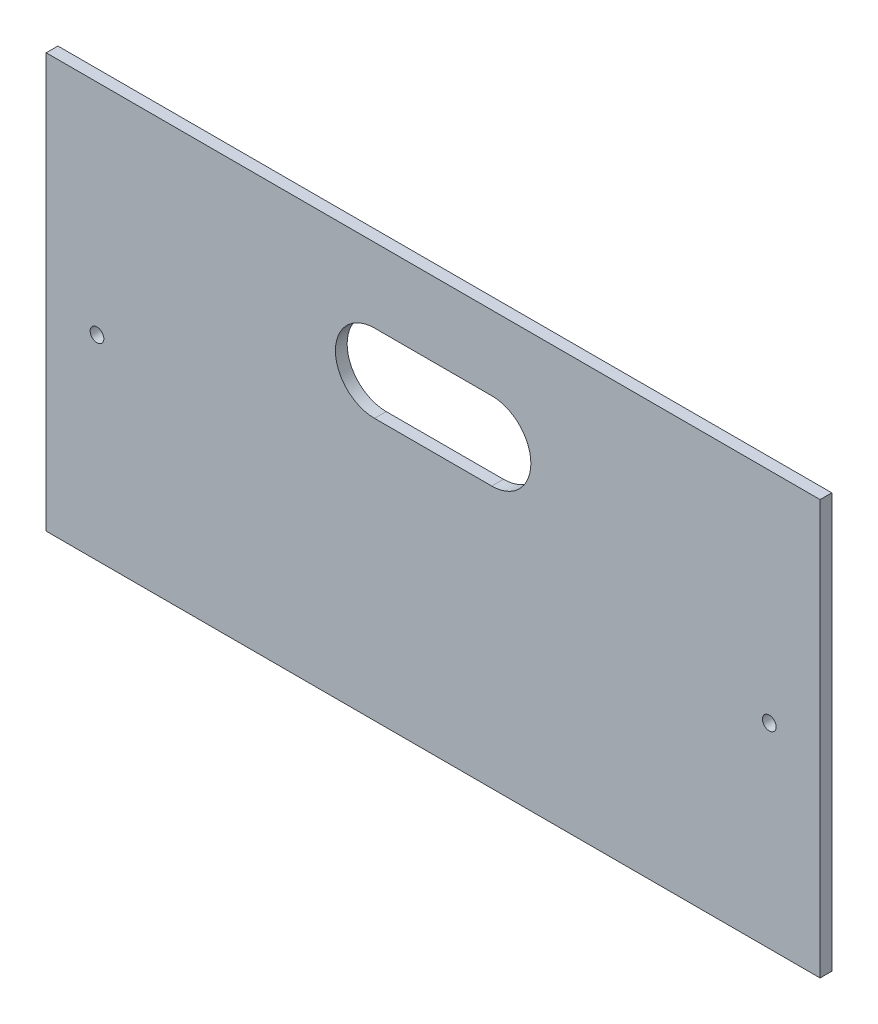
ISO-10303-21;
HEADER;
FILE_DESCRIPTION(('STEP AP214'),'2;1');
FILE_NAME('part.step','',(''),(''),'','','');
FILE_SCHEMA(('AUTOMOTIVE_DESIGN { 1 0 10303 214 1 1 1 1 }'));
ENDSEC;
DATA;
#1=APPLICATION_CONTEXT('core data for automotive mechanical design processes');
#2=APPLICATION_PROTOCOL_DEFINITION('international standard','automotive_design',2000,#1);
#3=PRODUCT_CONTEXT('',#1,'mechanical');
#4=PRODUCT('Part','Part','',(#3));
#5=PRODUCT_RELATED_PRODUCT_CATEGORY('part','',(#4));
#6=PRODUCT_DEFINITION_FORMATION('','',#4);
#7=PRODUCT_DEFINITION_CONTEXT('part definition',#1,'design');
#8=PRODUCT_DEFINITION('design','',#6,#7);
#9=PRODUCT_DEFINITION_SHAPE('','',#8);
#10=(LENGTH_UNIT() NAMED_UNIT(*) SI_UNIT(.MILLI.,.METRE.));
#11=(NAMED_UNIT(*) PLANE_ANGLE_UNIT() SI_UNIT($,.RADIAN.));
#12=(NAMED_UNIT(*) SI_UNIT($,.STERADIAN.) SOLID_ANGLE_UNIT());
#13=UNCERTAINTY_MEASURE_WITH_UNIT(LENGTH_MEASURE(1.E-05),#10,'distance_accuracy_value','');
#14=(GEOMETRIC_REPRESENTATION_CONTEXT(3) GLOBAL_UNCERTAINTY_ASSIGNED_CONTEXT((#13)) GLOBAL_UNIT_ASSIGNED_CONTEXT((#10,
#11,#12)) REPRESENTATION_CONTEXT('',''));
#15=CARTESIAN_POINT('',(0.,0.,0.));
#16=DIRECTION('',(0.,0.,1.));
#17=DIRECTION('',(1.,0.,0.));
#18=AXIS2_PLACEMENT_3D('',#15,#16,#17);
#19=CARTESIAN_POINT('',(0.,0.,3.));
#20=DIRECTION('',(0.,0.,-1.));
#21=DIRECTION('',(-1.,0.,0.));
#22=AXIS2_PLACEMENT_3D('',#19,#20,#21);
#23=PLANE('',#22);
#24=DIRECTION('',(1.,0.,0.));
#25=VECTOR('',#24,1.);
#26=CARTESIAN_POINT('',(15.,34.,3.));
#27=LINE('',#26,#25);
#28=CARTESIAN_POINT('',(-15.,34.,3.));
#29=VERTEX_POINT('',#28);
#30=CARTESIAN_POINT('',(15.,34.,3.));
#31=VERTEX_POINT('',#30);
#32=EDGE_CURVE('E116',#29,#31,#27,.T.);
#33=ORIENTED_EDGE('',*,*,#32,.T.);
#34=CARTESIAN_POINT('',(15.,24.,3.));
#35=DIRECTION('',(0.,0.,-1.));
#36=DIRECTION('',(-1.,0.,0.));
#37=AXIS2_PLACEMENT_3D('',#34,#35,#36);
#38=CIRCLE('',#37,10.);
#39=CARTESIAN_POINT('',(15.,14.,3.));
#40=VERTEX_POINT('',#39);
#41=EDGE_CURVE('E110',#31,#40,#38,.T.);
#42=ORIENTED_EDGE('',*,*,#41,.T.);
#43=DIRECTION('',(-1.,0.,0.));
#44=VECTOR('',#43,1.);
#45=CARTESIAN_POINT('',(15.,14.,3.));
#46=LINE('',#45,#44);
#47=CARTESIAN_POINT('',(-15.,14.,3.));
#48=VERTEX_POINT('',#47);
#49=EDGE_CURVE('E119',#40,#48,#46,.T.);
#50=ORIENTED_EDGE('',*,*,#49,.T.);
#51=CARTESIAN_POINT('',(-15.,24.,3.));
#52=DIRECTION('',(0.,0.,-1.));
#53=DIRECTION('',(-1.,0.,0.));
#54=AXIS2_PLACEMENT_3D('',#51,#52,#53);
#55=CIRCLE('',#54,10.);
#56=EDGE_CURVE('E58',#48,#29,#55,.T.);
#57=ORIENTED_EDGE('',*,*,#56,.T.);
#58=EDGE_LOOP('',(#33,#42,#50,#57));
#59=FACE_BOUND('',#58,.T.);
#60=DIRECTION('',(0.,-1.,0.));
#61=VECTOR('',#60,1.);
#62=CARTESIAN_POINT('',(-99.,52.9999999999999,3.));
#63=LINE('',#62,#61);
#64=CARTESIAN_POINT('',(-99.,52.9999999999999,3.));
#65=VERTEX_POINT('',#64);
#66=CARTESIAN_POINT('',(-99.,-53.0000000000001,3.));
#67=VERTEX_POINT('',#66);
#68=EDGE_CURVE('E156',#65,#67,#63,.T.);
#69=ORIENTED_EDGE('',*,*,#68,.T.);
#70=DIRECTION('',(1.,0.,0.));
#71=VECTOR('',#70,1.);
#72=CARTESIAN_POINT('',(99.,-53.,3.));
#73=LINE('',#72,#71);
#74=CARTESIAN_POINT('',(99.,-53.,3.));
#75=VERTEX_POINT('',#74);
#76=EDGE_CURVE('E159',#67,#75,#73,.T.);
#77=ORIENTED_EDGE('',*,*,#76,.T.);
#78=DIRECTION('',(0.,1.,0.));
#79=VECTOR('',#78,1.);
#80=CARTESIAN_POINT('',(99.,53.,3.));
#81=LINE('',#80,#79);
#82=CARTESIAN_POINT('',(99.,53.,3.));
#83=VERTEX_POINT('',#82);
#84=EDGE_CURVE('E162',#75,#83,#81,.T.);
#85=ORIENTED_EDGE('',*,*,#84,.T.);
#86=DIRECTION('',(-1.,0.,0.));
#87=VECTOR('',#86,1.);
#88=CARTESIAN_POINT('',(99.,53.,3.));
#89=LINE('',#88,#87);
#90=EDGE_CURVE('E164',#83,#65,#89,.T.);
#91=ORIENTED_EDGE('',*,*,#90,.T.);
#92=EDGE_LOOP('',(#69,#77,#85,#91));
#93=FACE_BOUND('',#92,.T.);
#94=CARTESIAN_POINT('',(-86.,-3.00000000000005,3.));
#95=DIRECTION('',(0.,0.,1.));
#96=DIRECTION('',(1.,0.,0.));
#97=AXIS2_PLACEMENT_3D('',#94,#95,#96);
#98=CIRCLE('',#97,1.75);
#99=CARTESIAN_POINT('',(-84.25,-3.00000000000005,3.));
#100=VERTEX_POINT('',#99);
#101=EDGE_CURVE('E150',#100,#100,#98,.T.);
#102=ORIENTED_EDGE('',*,*,#101,.F.);
#103=EDGE_LOOP('',(#102));
#104=FACE_BOUND('',#103,.T.);
#105=CARTESIAN_POINT('',(86.,-3.00000000000003,3.));
#106=DIRECTION('',(0.,0.,1.));
#107=DIRECTION('',(-1.,0.,0.));
#108=AXIS2_PLACEMENT_3D('',#105,#106,#107);
#109=CIRCLE('',#108,1.75);
#110=CARTESIAN_POINT('',(84.25,-3.00000000000003,3.));
#111=VERTEX_POINT('',#110);
#112=EDGE_CURVE('E144',#111,#111,#109,.T.);
#113=ORIENTED_EDGE('',*,*,#112,.F.);
#114=EDGE_LOOP('',(#113));
#115=FACE_BOUND('',#114,.T.);
#116=ADVANCED_FACE('F43',(#59,#93,#104,#115),#23,.F.);
#117=CARTESIAN_POINT('',(0.,0.,0.));
#118=DIRECTION('',(0.,0.,-1.));
#119=DIRECTION('',(-1.,0.,0.));
#120=AXIS2_PLACEMENT_3D('',#117,#118,#119);
#121=PLANE('',#120);
#122=CARTESIAN_POINT('',(15.,24.,0.));
#123=DIRECTION('',(0.,0.,-1.));
#124=DIRECTION('',(-1.,0.,0.));
#125=AXIS2_PLACEMENT_3D('',#122,#123,#124);
#126=CIRCLE('',#125,10.);
#127=CARTESIAN_POINT('',(15.,34.,0.));
#128=VERTEX_POINT('',#127);
#129=CARTESIAN_POINT('',(15.,14.,0.));
#130=VERTEX_POINT('',#129);
#131=EDGE_CURVE('E66',#128,#130,#126,.T.);
#132=ORIENTED_EDGE('',*,*,#131,.F.);
#133=DIRECTION('',(1.,0.,0.));
#134=VECTOR('',#133,1.);
#135=CARTESIAN_POINT('',(15.,34.,0.));
#136=LINE('',#135,#134);
#137=CARTESIAN_POINT('',(-15.,34.,0.));
#138=VERTEX_POINT('',#137);
#139=EDGE_CURVE('E125',#138,#128,#136,.T.);
#140=ORIENTED_EDGE('',*,*,#139,.F.);
#141=CARTESIAN_POINT('',(-15.,24.,0.));
#142=DIRECTION('',(0.,0.,-1.));
#143=DIRECTION('',(-1.,0.,0.));
#144=AXIS2_PLACEMENT_3D('',#141,#142,#143);
#145=CIRCLE('',#144,10.);
#146=CARTESIAN_POINT('',(-15.,14.,0.));
#147=VERTEX_POINT('',#146);
#148=EDGE_CURVE('E128',#147,#138,#145,.T.);
#149=ORIENTED_EDGE('',*,*,#148,.F.);
#150=DIRECTION('',(-1.,0.,0.));
#151=VECTOR('',#150,1.);
#152=CARTESIAN_POINT('',(15.,14.,0.));
#153=LINE('',#152,#151);
#154=EDGE_CURVE('E134',#130,#147,#153,.T.);
#155=ORIENTED_EDGE('',*,*,#154,.F.);
#156=EDGE_LOOP('',(#132,#140,#149,#155));
#157=FACE_BOUND('',#156,.T.);
#158=CARTESIAN_POINT('',(-86.,-3.00000000000005,0.));
#159=DIRECTION('',(0.,0.,1.));
#160=DIRECTION('',(1.,0.,0.));
#161=AXIS2_PLACEMENT_3D('',#158,#159,#160);
#162=CIRCLE('',#161,1.75);
#163=CARTESIAN_POINT('',(-84.25,-3.00000000000005,0.));
#164=VERTEX_POINT('',#163);
#165=EDGE_CURVE('E147',#164,#164,#162,.T.);
#166=ORIENTED_EDGE('',*,*,#165,.T.);
#167=EDGE_LOOP('',(#166));
#168=FACE_BOUND('',#167,.T.);
#169=DIRECTION('',(0.,-1.,0.));
#170=VECTOR('',#169,1.);
#171=CARTESIAN_POINT('',(-99.,52.9999999999999,0.));
#172=LINE('',#171,#170);
#173=CARTESIAN_POINT('',(-99.,52.9999999999999,0.));
#174=VERTEX_POINT('',#173);
#175=CARTESIAN_POINT('',(-99.,-53.0000000000001,0.));
#176=VERTEX_POINT('',#175);
#177=EDGE_CURVE('E153',#174,#176,#172,.T.);
#178=ORIENTED_EDGE('',*,*,#177,.F.);
#179=DIRECTION('',(-1.,0.,0.));
#180=VECTOR('',#179,1.);
#181=CARTESIAN_POINT('',(99.,53.,0.));
#182=LINE('',#181,#180);
#183=CARTESIAN_POINT('',(99.,53.,0.));
#184=VERTEX_POINT('',#183);
#185=EDGE_CURVE('E160',#184,#174,#182,.T.);
#186=ORIENTED_EDGE('',*,*,#185,.F.);
#187=DIRECTION('',(0.,1.,0.));
#188=VECTOR('',#187,1.);
#189=CARTESIAN_POINT('',(99.,53.,0.));
#190=LINE('',#189,#188);
#191=CARTESIAN_POINT('',(99.,-53.,0.));
#192=VERTEX_POINT('',#191);
#193=EDGE_CURVE('E171',#192,#184,#190,.T.);
#194=ORIENTED_EDGE('',*,*,#193,.F.);
#195=DIRECTION('',(1.,0.,0.));
#196=VECTOR('',#195,1.);
#197=CARTESIAN_POINT('',(99.,-53.,0.));
#198=LINE('',#197,#196);
#199=EDGE_CURVE('E169',#176,#192,#198,.T.);
#200=ORIENTED_EDGE('',*,*,#199,.F.);
#201=EDGE_LOOP('',(#178,#186,#194,#200));
#202=FACE_BOUND('',#201,.T.);
#203=CARTESIAN_POINT('',(86.,-3.00000000000003,0.));
#204=DIRECTION('',(0.,0.,1.));
#205=DIRECTION('',(-1.,0.,0.));
#206=AXIS2_PLACEMENT_3D('',#203,#204,#205);
#207=CIRCLE('',#206,1.75);
#208=CARTESIAN_POINT('',(84.25,-3.00000000000003,0.));
#209=VERTEX_POINT('',#208);
#210=EDGE_CURVE('E140',#209,#209,#207,.T.);
#211=ORIENTED_EDGE('',*,*,#210,.T.);
#212=EDGE_LOOP('',(#211));
#213=FACE_BOUND('',#212,.T.);
#214=ADVANCED_FACE('F189',(#157,#168,#202,#213),#121,.T.);
#215=CARTESIAN_POINT('',(-99.,52.9999999999999,3.));
#216=DIRECTION('',(1.,0.,0.));
#217=DIRECTION('',(0.,1.,0.));
#218=AXIS2_PLACEMENT_3D('',#215,#216,#217);
#219=PLANE('',#218);
#220=ORIENTED_EDGE('',*,*,#177,.T.);
#221=DIRECTION('',(0.,0.,-1.));
#222=VECTOR('',#221,1.);
#223=CARTESIAN_POINT('',(-99.,-53.0000000000001,3.));
#224=LINE('',#223,#222);
#225=EDGE_CURVE('E11',#67,#176,#224,.T.);
#226=ORIENTED_EDGE('',*,*,#225,.F.);
#227=ORIENTED_EDGE('',*,*,#68,.F.);
#228=DIRECTION('',(0.,0.,-1.));
#229=VECTOR('',#228,1.);
#230=CARTESIAN_POINT('',(-99.,52.9999999999999,3.));
#231=LINE('',#230,#229);
#232=EDGE_CURVE('E166',#65,#174,#231,.T.);
#233=ORIENTED_EDGE('',*,*,#232,.T.);
#234=EDGE_LOOP('',(#220,#226,#227,#233));
#235=FACE_BOUND('',#234,.T.);
#236=ADVANCED_FACE('F45',(#235),#219,.F.);
#237=CARTESIAN_POINT('',(99.,-53.,3.));
#238=DIRECTION('',(0.,1.,0.));
#239=DIRECTION('',(-1.,0.,0.));
#240=AXIS2_PLACEMENT_3D('',#237,#238,#239);
#241=PLANE('',#240);
#242=ORIENTED_EDGE('',*,*,#199,.T.);
#243=DIRECTION('',(0.,0.,-1.));
#244=VECTOR('',#243,1.);
#245=CARTESIAN_POINT('',(99.,-53.,3.));
#246=LINE('',#245,#244);
#247=EDGE_CURVE('E51',#75,#192,#246,.T.);
#248=ORIENTED_EDGE('',*,*,#247,.F.);
#249=ORIENTED_EDGE('',*,*,#76,.F.);
#250=ORIENTED_EDGE('',*,*,#225,.T.);
#251=EDGE_LOOP('',(#242,#248,#249,#250));
#252=FACE_BOUND('',#251,.T.);
#253=ADVANCED_FACE('F199',(#252),#241,.F.);
#254=CARTESIAN_POINT('',(99.,53.,3.));
#255=DIRECTION('',(-1.,0.,0.));
#256=DIRECTION('',(0.,-1.,0.));
#257=AXIS2_PLACEMENT_3D('',#254,#255,#256);
#258=PLANE('',#257);
#259=ORIENTED_EDGE('',*,*,#193,.T.);
#260=DIRECTION('',(0.,0.,-1.));
#261=VECTOR('',#260,1.);
#262=CARTESIAN_POINT('',(99.,53.,3.));
#263=LINE('',#262,#261);
#264=EDGE_CURVE('E176',#83,#184,#263,.T.);
#265=ORIENTED_EDGE('',*,*,#264,.F.);
#266=ORIENTED_EDGE('',*,*,#84,.F.);
#267=ORIENTED_EDGE('',*,*,#247,.T.);
#268=EDGE_LOOP('',(#259,#265,#266,#267));
#269=FACE_BOUND('',#268,.T.);
#270=ADVANCED_FACE('F183',(#269),#258,.F.);
#271=CARTESIAN_POINT('',(99.,53.,3.));
#272=DIRECTION('',(0.,-1.,0.));
#273=DIRECTION('',(1.,0.,0.));
#274=AXIS2_PLACEMENT_3D('',#271,#272,#273);
#275=PLANE('',#274);
#276=ORIENTED_EDGE('',*,*,#185,.T.);
#277=ORIENTED_EDGE('',*,*,#232,.F.);
#278=ORIENTED_EDGE('',*,*,#90,.F.);
#279=ORIENTED_EDGE('',*,*,#264,.T.);
#280=EDGE_LOOP('',(#276,#277,#278,#279));
#281=FACE_BOUND('',#280,.T.);
#282=ADVANCED_FACE('F193',(#281),#275,.F.);
#283=CARTESIAN_POINT('',(-86.,-3.00000000000005,3.));
#284=DIRECTION('',(0.,0.,-1.));
#285=DIRECTION('',(-1.,0.,0.));
#286=AXIS2_PLACEMENT_3D('',#283,#284,#285);
#287=CYLINDRICAL_SURFACE('',#286,1.75);
#288=ORIENTED_EDGE('',*,*,#101,.T.);
#289=EDGE_LOOP('',(#288));
#290=FACE_BOUND('',#289,.T.);
#291=ORIENTED_EDGE('',*,*,#165,.F.);
#292=EDGE_LOOP('',(#291));
#293=FACE_BOUND('',#292,.T.);
#294=ADVANCED_FACE('F215',(#290,#293),#287,.F.);
#295=CARTESIAN_POINT('',(86.,-3.00000000000003,3.));
#296=DIRECTION('',(0.,0.,-1.));
#297=DIRECTION('',(-1.,0.,0.));
#298=AXIS2_PLACEMENT_3D('',#295,#296,#297);
#299=CYLINDRICAL_SURFACE('',#298,1.75);
#300=ORIENTED_EDGE('',*,*,#112,.T.);
#301=EDGE_LOOP('',(#300));
#302=FACE_BOUND('',#301,.T.);
#303=ORIENTED_EDGE('',*,*,#210,.F.);
#304=EDGE_LOOP('',(#303));
#305=FACE_BOUND('',#304,.T.);
#306=ADVANCED_FACE('F222',(#302,#305),#299,.F.);
#307=CARTESIAN_POINT('',(15.,24.,3.));
#308=DIRECTION('',(0.,0.,-1.));
#309=DIRECTION('',(-1.,0.,0.));
#310=AXIS2_PLACEMENT_3D('',#307,#308,#309);
#311=CYLINDRICAL_SURFACE('',#310,10.);
#312=ORIENTED_EDGE('',*,*,#131,.T.);
#313=DIRECTION('',(0.,0.,-1.));
#314=VECTOR('',#313,1.);
#315=CARTESIAN_POINT('',(15.,14.,3.));
#316=LINE('',#315,#314);
#317=EDGE_CURVE('E106',#40,#130,#316,.T.);
#318=ORIENTED_EDGE('',*,*,#317,.F.);
#319=ORIENTED_EDGE('',*,*,#41,.F.);
#320=DIRECTION('',(0.,0.,-1.));
#321=VECTOR('',#320,1.);
#322=CARTESIAN_POINT('',(15.,34.,3.));
#323=LINE('',#322,#321);
#324=EDGE_CURVE('E138',#31,#128,#323,.T.);
#325=ORIENTED_EDGE('',*,*,#324,.T.);
#326=EDGE_LOOP('',(#312,#318,#319,#325));
#327=FACE_BOUND('',#326,.T.);
#328=ADVANCED_FACE('F108',(#327),#311,.F.);
#329=CARTESIAN_POINT('',(15.,34.,3.));
#330=DIRECTION('',(0.,1.,0.));
#331=DIRECTION('',(-1.,0.,0.));
#332=AXIS2_PLACEMENT_3D('',#329,#330,#331);
#333=PLANE('',#332);
#334=ORIENTED_EDGE('',*,*,#139,.T.);
#335=ORIENTED_EDGE('',*,*,#324,.F.);
#336=ORIENTED_EDGE('',*,*,#32,.F.);
#337=DIRECTION('',(0.,0.,-1.));
#338=VECTOR('',#337,1.);
#339=CARTESIAN_POINT('',(-15.,34.,3.));
#340=LINE('',#339,#338);
#341=EDGE_CURVE('E141',#29,#138,#340,.T.);
#342=ORIENTED_EDGE('',*,*,#341,.T.);
#343=EDGE_LOOP('',(#334,#335,#336,#342));
#344=FACE_BOUND('',#343,.T.);
#345=ADVANCED_FACE('F238',(#344),#333,.F.);
#346=CARTESIAN_POINT('',(-15.,24.,3.));
#347=DIRECTION('',(0.,0.,-1.));
#348=DIRECTION('',(-1.,0.,0.));
#349=AXIS2_PLACEMENT_3D('',#346,#347,#348);
#350=CYLINDRICAL_SURFACE('',#349,10.);
#351=ORIENTED_EDGE('',*,*,#148,.T.);
#352=ORIENTED_EDGE('',*,*,#341,.F.);
#353=ORIENTED_EDGE('',*,*,#56,.F.);
#354=DIRECTION('',(0.,0.,-1.));
#355=VECTOR('',#354,1.);
#356=CARTESIAN_POINT('',(-15.,14.,3.));
#357=LINE('',#356,#355);
#358=EDGE_CURVE('E115',#48,#147,#357,.T.);
#359=ORIENTED_EDGE('',*,*,#358,.T.);
#360=EDGE_LOOP('',(#351,#352,#353,#359));
#361=FACE_BOUND('',#360,.T.);
#362=ADVANCED_FACE('F243',(#361),#350,.F.);
#363=CARTESIAN_POINT('',(15.,14.,3.));
#364=DIRECTION('',(0.,-1.,0.));
#365=DIRECTION('',(1.,0.,0.));
#366=AXIS2_PLACEMENT_3D('',#363,#364,#365);
#367=PLANE('',#366);
#368=ORIENTED_EDGE('',*,*,#154,.T.);
#369=ORIENTED_EDGE('',*,*,#358,.F.);
#370=ORIENTED_EDGE('',*,*,#49,.F.);
#371=ORIENTED_EDGE('',*,*,#317,.T.);
#372=EDGE_LOOP('',(#368,#369,#370,#371));
#373=FACE_BOUND('',#372,.T.);
#374=ADVANCED_FACE('F120',(#373),#367,.F.);
#375=CLOSED_SHELL('',(#116,#214,#236,#253,#270,#282,#294,#306,#328,#345,#362,#374));
#376=MANIFOLD_SOLID_BREP('B2',#375);
#377=ADVANCED_BREP_SHAPE_REPRESENTATION('',(#18,#376),#14);
#378=SHAPE_DEFINITION_REPRESENTATION(#9,#377);
ENDSEC;
END-ISO-10303-21;
